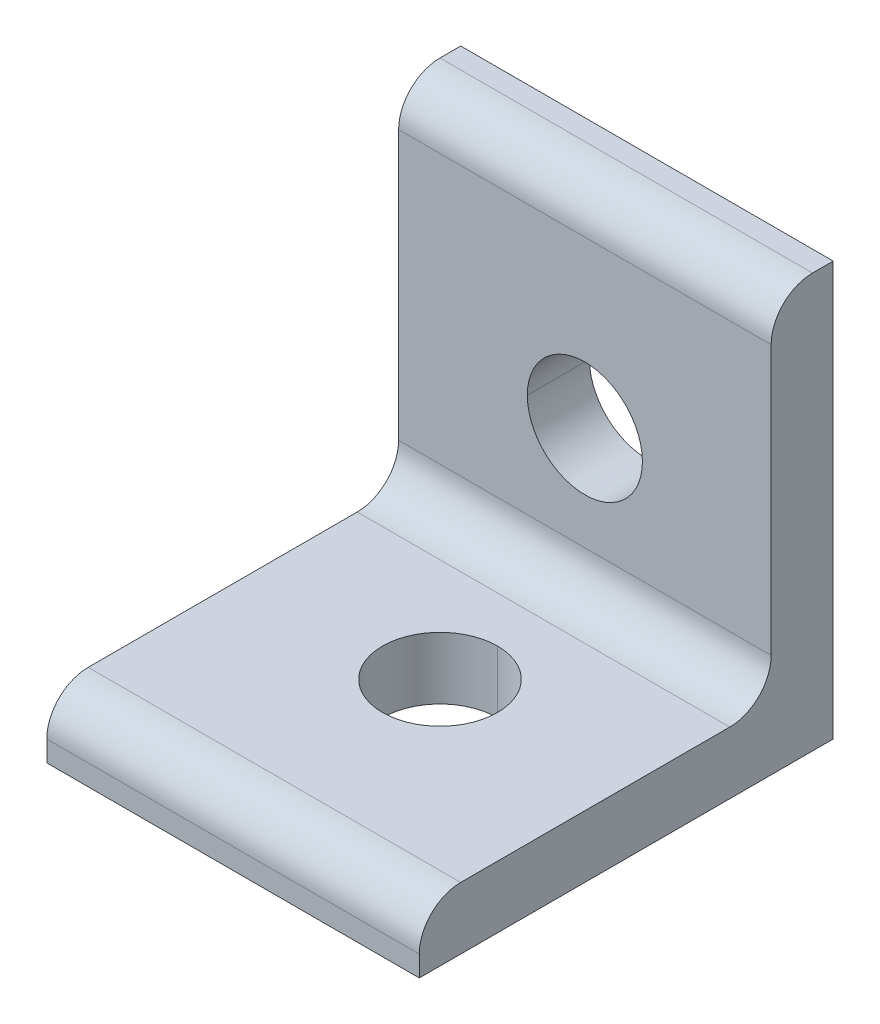
ISO-10303-21;
HEADER;
FILE_DESCRIPTION(('STEP AP214'),'2;1');
FILE_NAME('part.step','',(''),(''),'','','');
FILE_SCHEMA(('AUTOMOTIVE_DESIGN { 1 0 10303 214 1 1 1 1 }'));
ENDSEC;
DATA;
#1=APPLICATION_CONTEXT('core data for automotive mechanical design processes');
#2=APPLICATION_PROTOCOL_DEFINITION('international standard','automotive_design',2000,#1);
#3=PRODUCT_CONTEXT('',#1,'mechanical');
#4=PRODUCT('Part','Part','',(#3));
#5=PRODUCT_RELATED_PRODUCT_CATEGORY('part','',(#4));
#6=PRODUCT_DEFINITION_FORMATION('','',#4);
#7=PRODUCT_DEFINITION_CONTEXT('part definition',#1,'design');
#8=PRODUCT_DEFINITION('design','',#6,#7);
#9=PRODUCT_DEFINITION_SHAPE('','',#8);
#10=(LENGTH_UNIT() NAMED_UNIT(*) SI_UNIT(.MILLI.,.METRE.));
#11=(NAMED_UNIT(*) PLANE_ANGLE_UNIT() SI_UNIT($,.RADIAN.));
#12=(NAMED_UNIT(*) SI_UNIT($,.STERADIAN.) SOLID_ANGLE_UNIT());
#13=UNCERTAINTY_MEASURE_WITH_UNIT(LENGTH_MEASURE(1.E-05),#10,'distance_accuracy_value','');
#14=(GEOMETRIC_REPRESENTATION_CONTEXT(3) GLOBAL_UNCERTAINTY_ASSIGNED_CONTEXT((#13)) GLOBAL_UNIT_ASSIGNED_CONTEXT((#10,
#11,#12)) REPRESENTATION_CONTEXT('',''));
#15=CARTESIAN_POINT('',(0.,0.,0.));
#16=DIRECTION('',(0.,0.,1.));
#17=DIRECTION('',(1.,0.,0.));
#18=AXIS2_PLACEMENT_3D('',#15,#16,#17);
#19=CARTESIAN_POINT('',(9.,0.999999999999849,18.));
#20=DIRECTION('',(-1.,0.,0.));
#21=DIRECTION('',(0.,-0.707106781186574,-0.707106781186521));
#22=AXIS2_PLACEMENT_3D('',#19,#20,#21);
#23=CYLINDRICAL_SURFACE('',#22,2.00000000000015);
#24=CARTESIAN_POINT('',(-9.,0.999999999999849,18.));
#25=DIRECTION('',(1.,0.,0.));
#26=DIRECTION('',(0.,0.,-1.));
#27=AXIS2_PLACEMENT_3D('',#24,#25,#26);
#28=CIRCLE('',#27,2.00000000000015);
#29=CARTESIAN_POINT('',(-9.,3.,18.));
#30=VERTEX_POINT('',#29);
#31=CARTESIAN_POINT('',(-9.,1.,20.));
#32=VERTEX_POINT('',#31);
#33=EDGE_CURVE('E11',#30,#32,#28,.T.);
#34=ORIENTED_EDGE('',*,*,#33,.T.);
#35=DIRECTION('',(-1.,0.,0.));
#36=VECTOR('',#35,1.);
#37=CARTESIAN_POINT('',(9.,1.,20.));
#38=LINE('',#37,#36);
#39=CARTESIAN_POINT('',(9.,1.,20.));
#40=VERTEX_POINT('',#39);
#41=EDGE_CURVE('E24',#40,#32,#38,.T.);
#42=ORIENTED_EDGE('',*,*,#41,.F.);
#43=CARTESIAN_POINT('',(9.,0.999999999999849,18.));
#44=DIRECTION('',(1.,0.,0.));
#45=DIRECTION('',(0.,0.,-1.));
#46=AXIS2_PLACEMENT_3D('',#43,#44,#45);
#47=CIRCLE('',#46,2.00000000000015);
#48=CARTESIAN_POINT('',(9.,3.,18.));
#49=VERTEX_POINT('',#48);
#50=EDGE_CURVE('E254',#49,#40,#47,.T.);
#51=ORIENTED_EDGE('',*,*,#50,.F.);
#52=DIRECTION('',(-1.,0.,0.));
#53=VECTOR('',#52,1.);
#54=CARTESIAN_POINT('',(9.,3.,18.));
#55=LINE('',#54,#53);
#56=EDGE_CURVE('E250',#49,#30,#55,.T.);
#57=ORIENTED_EDGE('',*,*,#56,.T.);
#58=EDGE_LOOP('',(#34,#42,#51,#57));
#59=FACE_BOUND('',#58,.T.);
#60=ADVANCED_FACE('F16',(#59),#23,.T.);
#61=CARTESIAN_POINT('',(9.,3.,5.));
#62=DIRECTION('',(0.,-1.,0.));
#63=DIRECTION('',(0.,0.,-1.));
#64=AXIS2_PLACEMENT_3D('',#61,#62,#63);
#65=PLANE('',#64);
#66=CARTESIAN_POINT('',(0.,3.,10.));
#67=DIRECTION('',(0.,1.,0.));
#68=DIRECTION('',(1.,0.,0.));
#69=AXIS2_PLACEMENT_3D('',#66,#67,#68);
#70=CIRCLE('',#69,2.78);
#71=CARTESIAN_POINT('',(0.,3.,7.22));
#72=VERTEX_POINT('',#71);
#73=CARTESIAN_POINT('',(0.,3.,12.78));
#74=VERTEX_POINT('',#73);
#75=EDGE_CURVE('E245',#72,#74,#70,.T.);
#76=ORIENTED_EDGE('',*,*,#75,.F.);
#77=CARTESIAN_POINT('',(0.,3.,10.));
#78=DIRECTION('',(0.,1.,0.));
#79=DIRECTION('',(0.,0.,1.));
#80=AXIS2_PLACEMENT_3D('',#77,#78,#79);
#81=CIRCLE('',#80,2.78);
#82=EDGE_CURVE('E240',#74,#72,#81,.T.);
#83=ORIENTED_EDGE('',*,*,#82,.F.);
#84=EDGE_LOOP('',(#76,#83));
#85=FACE_BOUND('',#84,.T.);
#86=DIRECTION('',(0.,0.,1.));
#87=VECTOR('',#86,1.);
#88=CARTESIAN_POINT('',(-9.,3.,5.));
#89=LINE('',#88,#87);
#90=CARTESIAN_POINT('',(-9.,3.,5.));
#91=VERTEX_POINT('',#90);
#92=EDGE_CURVE('E235',#91,#30,#89,.T.);
#93=ORIENTED_EDGE('',*,*,#92,.T.);
#94=ORIENTED_EDGE('',*,*,#56,.F.);
#95=DIRECTION('',(0.,0.,1.));
#96=VECTOR('',#95,1.);
#97=CARTESIAN_POINT('',(9.,3.,5.));
#98=LINE('',#97,#96);
#99=CARTESIAN_POINT('',(9.,3.,5.));
#100=VERTEX_POINT('',#99);
#101=EDGE_CURVE('E230',#100,#49,#98,.T.);
#102=ORIENTED_EDGE('',*,*,#101,.F.);
#103=DIRECTION('',(-1.,0.,0.));
#104=VECTOR('',#103,1.);
#105=CARTESIAN_POINT('',(9.,3.,5.));
#106=LINE('',#105,#104);
#107=EDGE_CURVE('E226',#100,#91,#106,.T.);
#108=ORIENTED_EDGE('',*,*,#107,.T.);
#109=EDGE_LOOP('',(#93,#94,#102,#108));
#110=FACE_BOUND('',#109,.T.);
#111=ADVANCED_FACE('F269',(#85,#110),#65,.F.);
#112=CARTESIAN_POINT('',(9.,5.,5.));
#113=DIRECTION('',(-1.,0.,0.));
#114=DIRECTION('',(0.,0.707106781186548,0.707106781186548));
#115=AXIS2_PLACEMENT_3D('',#112,#113,#114);
#116=CYLINDRICAL_SURFACE('',#115,2.);
#117=CARTESIAN_POINT('',(-9.,5.,5.));
#118=DIRECTION('',(1.,0.,0.));
#119=DIRECTION('',(0.,0.,-1.));
#120=AXIS2_PLACEMENT_3D('',#117,#118,#119);
#121=CIRCLE('',#120,2.);
#122=CARTESIAN_POINT('',(-9.,5.,3.));
#123=VERTEX_POINT('',#122);
#124=EDGE_CURVE('E221',#91,#123,#121,.T.);
#125=ORIENTED_EDGE('',*,*,#124,.F.);
#126=ORIENTED_EDGE('',*,*,#107,.F.);
#127=CARTESIAN_POINT('',(9.,5.,5.));
#128=DIRECTION('',(1.,0.,0.));
#129=DIRECTION('',(0.,0.,-1.));
#130=AXIS2_PLACEMENT_3D('',#127,#128,#129);
#131=CIRCLE('',#130,2.);
#132=CARTESIAN_POINT('',(9.,5.,3.));
#133=VERTEX_POINT('',#132);
#134=EDGE_CURVE('E217',#100,#133,#131,.T.);
#135=ORIENTED_EDGE('',*,*,#134,.T.);
#136=DIRECTION('',(-1.,0.,0.));
#137=VECTOR('',#136,1.);
#138=CARTESIAN_POINT('',(9.,5.,3.));
#139=LINE('',#138,#137);
#140=EDGE_CURVE('E213',#133,#123,#139,.T.);
#141=ORIENTED_EDGE('',*,*,#140,.T.);
#142=EDGE_LOOP('',(#125,#126,#135,#141));
#143=FACE_BOUND('',#142,.T.);
#144=ADVANCED_FACE('F275',(#143),#116,.F.);
#145=CARTESIAN_POINT('',(9.,18.,3.));
#146=DIRECTION('',(0.,0.,-1.));
#147=DIRECTION('',(-1.,0.,0.));
#148=AXIS2_PLACEMENT_3D('',#145,#146,#147);
#149=PLANE('',#148);
#150=CARTESIAN_POINT('',(0.,10.,3.));
#151=DIRECTION('',(0.,0.,1.));
#152=DIRECTION('',(1.,0.,0.));
#153=AXIS2_PLACEMENT_3D('',#150,#151,#152);
#154=CIRCLE('',#153,2.78);
#155=CARTESIAN_POINT('',(-2.78,10.,3.));
#156=VERTEX_POINT('',#155);
#157=CARTESIAN_POINT('',(2.78,10.,3.));
#158=VERTEX_POINT('',#157);
#159=EDGE_CURVE('E208',#156,#158,#154,.T.);
#160=ORIENTED_EDGE('',*,*,#159,.F.);
#161=CARTESIAN_POINT('',(0.,10.,3.));
#162=DIRECTION('',(0.,0.,1.));
#163=DIRECTION('',(1.,0.,0.));
#164=AXIS2_PLACEMENT_3D('',#161,#162,#163);
#165=CIRCLE('',#164,2.78);
#166=EDGE_CURVE('E203',#158,#156,#165,.T.);
#167=ORIENTED_EDGE('',*,*,#166,.F.);
#168=EDGE_LOOP('',(#160,#167));
#169=FACE_BOUND('',#168,.T.);
#170=DIRECTION('',(0.,-1.,0.));
#171=VECTOR('',#170,1.);
#172=CARTESIAN_POINT('',(-9.,18.,3.));
#173=LINE('',#172,#171);
#174=CARTESIAN_POINT('',(-9.,18.,3.));
#175=VERTEX_POINT('',#174);
#176=EDGE_CURVE('E198',#175,#123,#173,.T.);
#177=ORIENTED_EDGE('',*,*,#176,.T.);
#178=ORIENTED_EDGE('',*,*,#140,.F.);
#179=DIRECTION('',(0.,-1.,0.));
#180=VECTOR('',#179,1.);
#181=CARTESIAN_POINT('',(9.,18.,3.));
#182=LINE('',#181,#180);
#183=CARTESIAN_POINT('',(9.,18.,3.));
#184=VERTEX_POINT('',#183);
#185=EDGE_CURVE('E193',#184,#133,#182,.T.);
#186=ORIENTED_EDGE('',*,*,#185,.F.);
#187=DIRECTION('',(-1.,0.,0.));
#188=VECTOR('',#187,1.);
#189=CARTESIAN_POINT('',(9.,18.,3.));
#190=LINE('',#189,#188);
#191=EDGE_CURVE('E189',#184,#175,#190,.T.);
#192=ORIENTED_EDGE('',*,*,#191,.T.);
#193=EDGE_LOOP('',(#177,#178,#186,#192));
#194=FACE_BOUND('',#193,.T.);
#195=ADVANCED_FACE('F278',(#169,#194),#149,.F.);
#196=CARTESIAN_POINT('',(9.,18.,0.999999999999849));
#197=DIRECTION('',(-1.,0.,0.));
#198=DIRECTION('',(0.,-0.707106781186521,-0.707106781186574));
#199=AXIS2_PLACEMENT_3D('',#196,#197,#198);
#200=CYLINDRICAL_SURFACE('',#199,2.00000000000015);
#201=CARTESIAN_POINT('',(-9.,18.,0.999999999999849));
#202=DIRECTION('',(1.,0.,0.));
#203=DIRECTION('',(0.,0.,-1.));
#204=AXIS2_PLACEMENT_3D('',#201,#202,#203);
#205=CIRCLE('',#204,2.00000000000015);
#206=CARTESIAN_POINT('',(-9.,20.,1.));
#207=VERTEX_POINT('',#206);
#208=EDGE_CURVE('E184',#207,#175,#205,.T.);
#209=ORIENTED_EDGE('',*,*,#208,.T.);
#210=ORIENTED_EDGE('',*,*,#191,.F.);
#211=CARTESIAN_POINT('',(9.,18.,0.999999999999849));
#212=DIRECTION('',(1.,0.,0.));
#213=DIRECTION('',(0.,0.,-1.));
#214=AXIS2_PLACEMENT_3D('',#211,#212,#213);
#215=CIRCLE('',#214,2.00000000000015);
#216=CARTESIAN_POINT('',(9.,20.,1.));
#217=VERTEX_POINT('',#216);
#218=EDGE_CURVE('E179',#217,#184,#215,.T.);
#219=ORIENTED_EDGE('',*,*,#218,.F.);
#220=DIRECTION('',(-1.,0.,0.));
#221=VECTOR('',#220,1.);
#222=CARTESIAN_POINT('',(9.,20.,1.));
#223=LINE('',#222,#221);
#224=EDGE_CURVE('E175',#217,#207,#223,.T.);
#225=ORIENTED_EDGE('',*,*,#224,.T.);
#226=EDGE_LOOP('',(#209,#210,#219,#225));
#227=FACE_BOUND('',#226,.T.);
#228=ADVANCED_FACE('F281',(#227),#200,.T.);
#229=CARTESIAN_POINT('',(9.,20.,0.));
#230=DIRECTION('',(0.,-1.,0.));
#231=DIRECTION('',(0.,0.,-1.));
#232=AXIS2_PLACEMENT_3D('',#229,#230,#231);
#233=PLANE('',#232);
#234=DIRECTION('',(0.,0.,1.));
#235=VECTOR('',#234,1.);
#236=CARTESIAN_POINT('',(-9.,20.,0.));
#237=LINE('',#236,#235);
#238=CARTESIAN_POINT('',(-9.,20.,0.));
#239=VERTEX_POINT('',#238);
#240=EDGE_CURVE('E170',#239,#207,#237,.T.);
#241=ORIENTED_EDGE('',*,*,#240,.T.);
#242=ORIENTED_EDGE('',*,*,#224,.F.);
#243=DIRECTION('',(0.,0.,1.));
#244=VECTOR('',#243,1.);
#245=CARTESIAN_POINT('',(9.,20.,0.));
#246=LINE('',#245,#244);
#247=CARTESIAN_POINT('',(9.,20.,0.));
#248=VERTEX_POINT('',#247);
#249=EDGE_CURVE('E165',#248,#217,#246,.T.);
#250=ORIENTED_EDGE('',*,*,#249,.F.);
#251=DIRECTION('',(-1.,0.,0.));
#252=VECTOR('',#251,1.);
#253=CARTESIAN_POINT('',(9.,20.,0.));
#254=LINE('',#253,#252);
#255=EDGE_CURVE('E161',#248,#239,#254,.T.);
#256=ORIENTED_EDGE('',*,*,#255,.T.);
#257=EDGE_LOOP('',(#241,#242,#250,#256));
#258=FACE_BOUND('',#257,.T.);
#259=ADVANCED_FACE('F284',(#258),#233,.F.);
#260=CARTESIAN_POINT('',(9.,0.,0.));
#261=DIRECTION('',(0.,0.,1.));
#262=DIRECTION('',(1.,0.,0.));
#263=AXIS2_PLACEMENT_3D('',#260,#261,#262);
#264=PLANE('',#263);
#265=CARTESIAN_POINT('',(0.,10.,0.));
#266=DIRECTION('',(0.,0.,1.));
#267=DIRECTION('',(1.,0.,0.));
#268=AXIS2_PLACEMENT_3D('',#265,#266,#267);
#269=CIRCLE('',#268,2.78);
#270=CARTESIAN_POINT('',(2.78,10.,0.));
#271=VERTEX_POINT('',#270);
#272=CARTESIAN_POINT('',(-2.78,10.,0.));
#273=VERTEX_POINT('',#272);
#274=EDGE_CURVE('E157',#271,#273,#269,.T.);
#275=ORIENTED_EDGE('',*,*,#274,.T.);
#276=CARTESIAN_POINT('',(0.,10.,0.));
#277=DIRECTION('',(0.,0.,1.));
#278=DIRECTION('',(1.,0.,0.));
#279=AXIS2_PLACEMENT_3D('',#276,#277,#278);
#280=CIRCLE('',#279,2.78);
#281=EDGE_CURVE('E153',#273,#271,#280,.T.);
#282=ORIENTED_EDGE('',*,*,#281,.T.);
#283=EDGE_LOOP('',(#275,#282));
#284=FACE_BOUND('',#283,.T.);
#285=DIRECTION('',(0.,1.,0.));
#286=VECTOR('',#285,1.);
#287=CARTESIAN_POINT('',(-9.,0.,0.));
#288=LINE('',#287,#286);
#289=CARTESIAN_POINT('',(-9.,0.,0.));
#290=VERTEX_POINT('',#289);
#291=EDGE_CURVE('E127',#290,#239,#288,.T.);
#292=ORIENTED_EDGE('',*,*,#291,.T.);
#293=ORIENTED_EDGE('',*,*,#255,.F.);
#294=DIRECTION('',(0.,1.,0.));
#295=VECTOR('',#294,1.);
#296=CARTESIAN_POINT('',(9.,0.,0.));
#297=LINE('',#296,#295);
#298=CARTESIAN_POINT('',(9.,0.,0.));
#299=VERTEX_POINT('',#298);
#300=EDGE_CURVE('E145',#299,#248,#297,.T.);
#301=ORIENTED_EDGE('',*,*,#300,.F.);
#302=DIRECTION('',(-1.,0.,0.));
#303=VECTOR('',#302,1.);
#304=CARTESIAN_POINT('',(9.,0.,0.));
#305=LINE('',#304,#303);
#306=EDGE_CURVE('E141',#299,#290,#305,.T.);
#307=ORIENTED_EDGE('',*,*,#306,.T.);
#308=EDGE_LOOP('',(#292,#293,#301,#307));
#309=FACE_BOUND('',#308,.T.);
#310=ADVANCED_FACE('F287',(#284,#309),#264,.F.);
#311=CARTESIAN_POINT('',(9.,0.,20.));
#312=DIRECTION('',(0.,1.,0.));
#313=DIRECTION('',(0.,0.,1.));
#314=AXIS2_PLACEMENT_3D('',#311,#312,#313);
#315=PLANE('',#314);
#316=CARTESIAN_POINT('',(0.,0.,10.));
#317=DIRECTION('',(0.,1.,0.));
#318=DIRECTION('',(1.,0.,0.));
#319=AXIS2_PLACEMENT_3D('',#316,#317,#318);
#320=CIRCLE('',#319,2.78);
#321=CARTESIAN_POINT('',(0.,0.,7.22));
#322=VERTEX_POINT('',#321);
#323=CARTESIAN_POINT('',(0.,0.,12.78));
#324=VERTEX_POINT('',#323);
#325=EDGE_CURVE('E130',#322,#324,#320,.T.);
#326=ORIENTED_EDGE('',*,*,#325,.T.);
#327=CARTESIAN_POINT('',(0.,0.,10.));
#328=DIRECTION('',(0.,1.,0.));
#329=DIRECTION('',(0.,0.,1.));
#330=AXIS2_PLACEMENT_3D('',#327,#328,#329);
#331=CIRCLE('',#330,2.78);
#332=EDGE_CURVE('E128',#324,#322,#331,.T.);
#333=ORIENTED_EDGE('',*,*,#332,.T.);
#334=EDGE_LOOP('',(#326,#333));
#335=FACE_BOUND('',#334,.T.);
#336=DIRECTION('',(0.,0.,-1.));
#337=VECTOR('',#336,1.);
#338=CARTESIAN_POINT('',(-9.,0.,20.));
#339=LINE('',#338,#337);
#340=CARTESIAN_POINT('',(-9.,0.,20.));
#341=VERTEX_POINT('',#340);
#342=EDGE_CURVE('E112',#341,#290,#339,.T.);
#343=ORIENTED_EDGE('',*,*,#342,.T.);
#344=ORIENTED_EDGE('',*,*,#306,.F.);
#345=DIRECTION('',(0.,0.,-1.));
#346=VECTOR('',#345,1.);
#347=CARTESIAN_POINT('',(9.,0.,20.));
#348=LINE('',#347,#346);
#349=CARTESIAN_POINT('',(9.,0.,20.));
#350=VERTEX_POINT('',#349);
#351=EDGE_CURVE('E115',#350,#299,#348,.T.);
#352=ORIENTED_EDGE('',*,*,#351,.F.);
#353=DIRECTION('',(-1.,0.,0.));
#354=VECTOR('',#353,1.);
#355=CARTESIAN_POINT('',(9.,0.,20.));
#356=LINE('',#355,#354);
#357=EDGE_CURVE('E107',#350,#341,#356,.T.);
#358=ORIENTED_EDGE('',*,*,#357,.T.);
#359=EDGE_LOOP('',(#343,#344,#352,#358));
#360=FACE_BOUND('',#359,.T.);
#361=ADVANCED_FACE('F109',(#335,#360),#315,.F.);
#362=CARTESIAN_POINT('',(9.,1.,20.));
#363=DIRECTION('',(0.,0.,-1.));
#364=DIRECTION('',(-1.,0.,0.));
#365=AXIS2_PLACEMENT_3D('',#362,#363,#364);
#366=PLANE('',#365);
#367=DIRECTION('',(0.,-1.,0.));
#368=VECTOR('',#367,1.);
#369=CARTESIAN_POINT('',(-9.,1.,20.));
#370=LINE('',#369,#368);
#371=EDGE_CURVE('E118',#32,#341,#370,.T.);
#372=ORIENTED_EDGE('',*,*,#371,.T.);
#373=ORIENTED_EDGE('',*,*,#357,.F.);
#374=DIRECTION('',(0.,-1.,0.));
#375=VECTOR('',#374,1.);
#376=CARTESIAN_POINT('',(9.,1.,20.));
#377=LINE('',#376,#375);
#378=EDGE_CURVE('E122',#40,#350,#377,.T.);
#379=ORIENTED_EDGE('',*,*,#378,.F.);
#380=ORIENTED_EDGE('',*,*,#41,.T.);
#381=EDGE_LOOP('',(#372,#373,#379,#380));
#382=FACE_BOUND('',#381,.T.);
#383=ADVANCED_FACE('F120',(#382),#366,.F.);
#384=CARTESIAN_POINT('',(9.,0.999999999999849,18.));
#385=DIRECTION('',(1.,0.,0.));
#386=DIRECTION('',(0.,0.,-1.));
#387=AXIS2_PLACEMENT_3D('',#384,#385,#386);
#388=PLANE('',#387);
#389=ORIENTED_EDGE('',*,*,#50,.T.);
#390=ORIENTED_EDGE('',*,*,#378,.T.);
#391=ORIENTED_EDGE('',*,*,#351,.T.);
#392=ORIENTED_EDGE('',*,*,#300,.T.);
#393=ORIENTED_EDGE('',*,*,#249,.T.);
#394=ORIENTED_EDGE('',*,*,#218,.T.);
#395=ORIENTED_EDGE('',*,*,#185,.T.);
#396=ORIENTED_EDGE('',*,*,#134,.F.);
#397=ORIENTED_EDGE('',*,*,#101,.T.);
#398=EDGE_LOOP('',(#389,#390,#391,#392,#393,#394,#395,#396,#397));
#399=FACE_BOUND('',#398,.T.);
#400=ADVANCED_FACE('F264',(#399),#388,.T.);
#401=CARTESIAN_POINT('',(-9.,0.999999999999849,18.));
#402=DIRECTION('',(1.,0.,0.));
#403=DIRECTION('',(0.,0.,-1.));
#404=AXIS2_PLACEMENT_3D('',#401,#402,#403);
#405=PLANE('',#404);
#406=ORIENTED_EDGE('',*,*,#33,.F.);
#407=ORIENTED_EDGE('',*,*,#92,.F.);
#408=ORIENTED_EDGE('',*,*,#124,.T.);
#409=ORIENTED_EDGE('',*,*,#176,.F.);
#410=ORIENTED_EDGE('',*,*,#208,.F.);
#411=ORIENTED_EDGE('',*,*,#240,.F.);
#412=ORIENTED_EDGE('',*,*,#291,.F.);
#413=ORIENTED_EDGE('',*,*,#342,.F.);
#414=ORIENTED_EDGE('',*,*,#371,.F.);
#415=EDGE_LOOP('',(#406,#407,#408,#409,#410,#411,#412,#413,#414));
#416=FACE_BOUND('',#415,.T.);
#417=ADVANCED_FACE('F124',(#416),#405,.F.);
#418=CARTESIAN_POINT('',(0.,3.,10.));
#419=DIRECTION('',(0.,-1.,0.));
#420=DIRECTION('',(-1.,0.,0.));
#421=AXIS2_PLACEMENT_3D('',#418,#419,#420);
#422=CYLINDRICAL_SURFACE('',#421,2.78);
#423=DIRECTION('',(0.,-1.,0.));
#424=VECTOR('',#423,1.);
#425=CARTESIAN_POINT('',(0.,3.,12.78));
#426=LINE('',#425,#424);
#427=EDGE_CURVE('E477',#74,#324,#426,.T.);
#428=ORIENTED_EDGE('',*,*,#427,.F.);
#429=ORIENTED_EDGE('',*,*,#82,.T.);
#430=DIRECTION('',(0.,-1.,0.));
#431=VECTOR('',#430,1.);
#432=CARTESIAN_POINT('',(0.,3.,7.22));
#433=LINE('',#432,#431);
#434=EDGE_CURVE('E465',#72,#322,#433,.T.);
#435=ORIENTED_EDGE('',*,*,#434,.T.);
#436=ORIENTED_EDGE('',*,*,#332,.F.);
#437=EDGE_LOOP('',(#428,#429,#435,#436));
#438=FACE_BOUND('',#437,.T.);
#439=ADVANCED_FACE('F361',(#438),#422,.F.);
#440=CARTESIAN_POINT('',(0.,3.,10.));
#441=DIRECTION('',(0.,-1.,0.));
#442=DIRECTION('',(1.,0.,0.));
#443=AXIS2_PLACEMENT_3D('',#440,#441,#442);
#444=CYLINDRICAL_SURFACE('',#443,2.78);
#445=ORIENTED_EDGE('',*,*,#427,.T.);
#446=ORIENTED_EDGE('',*,*,#325,.F.);
#447=ORIENTED_EDGE('',*,*,#434,.F.);
#448=ORIENTED_EDGE('',*,*,#75,.T.);
#449=EDGE_LOOP('',(#445,#446,#447,#448));
#450=FACE_BOUND('',#449,.T.);
#451=ADVANCED_FACE('F370',(#450),#444,.F.);
#452=CARTESIAN_POINT('',(0.,10.,3.));
#453=DIRECTION('',(0.,0.,-1.));
#454=DIRECTION('',(0.,1.,0.));
#455=AXIS2_PLACEMENT_3D('',#452,#453,#454);
#456=CYLINDRICAL_SURFACE('',#455,2.78);
#457=DIRECTION('',(0.,0.,-1.));
#458=VECTOR('',#457,1.);
#459=CARTESIAN_POINT('',(2.78,10.,3.));
#460=LINE('',#459,#458);
#461=EDGE_CURVE('E462',#158,#271,#460,.T.);
#462=ORIENTED_EDGE('',*,*,#461,.T.);
#463=ORIENTED_EDGE('',*,*,#281,.F.);
#464=DIRECTION('',(0.,0.,-1.));
#465=VECTOR('',#464,1.);
#466=CARTESIAN_POINT('',(-2.78,10.,3.));
#467=LINE('',#466,#465);
#468=EDGE_CURVE('E466',#156,#273,#467,.T.);
#469=ORIENTED_EDGE('',*,*,#468,.F.);
#470=ORIENTED_EDGE('',*,*,#159,.T.);
#471=EDGE_LOOP('',(#462,#463,#469,#470));
#472=FACE_BOUND('',#471,.T.);
#473=ADVANCED_FACE('F380',(#472),#456,.F.);
#474=CARTESIAN_POINT('',(0.,10.,3.));
#475=DIRECTION('',(0.,0.,-1.));
#476=DIRECTION('',(0.,-1.,0.));
#477=AXIS2_PLACEMENT_3D('',#474,#475,#476);
#478=CYLINDRICAL_SURFACE('',#477,2.78);
#479=ORIENTED_EDGE('',*,*,#461,.F.);
#480=ORIENTED_EDGE('',*,*,#166,.T.);
#481=ORIENTED_EDGE('',*,*,#468,.T.);
#482=ORIENTED_EDGE('',*,*,#274,.F.);
#483=EDGE_LOOP('',(#479,#480,#481,#482));
#484=FACE_BOUND('',#483,.T.);
#485=ADVANCED_FACE('F390',(#484),#478,.F.);
#486=CLOSED_SHELL('',(#60,#111,#144,#195,#228,#259,#310,#361,#383,#400,#417,#439,#451,#473,#485));
#487=MANIFOLD_SOLID_BREP('B1',#486);
#488=ADVANCED_BREP_SHAPE_REPRESENTATION('',(#18,#487),#14);
#489=SHAPE_DEFINITION_REPRESENTATION(#9,#488);
ENDSEC;
END-ISO-10303-21;
